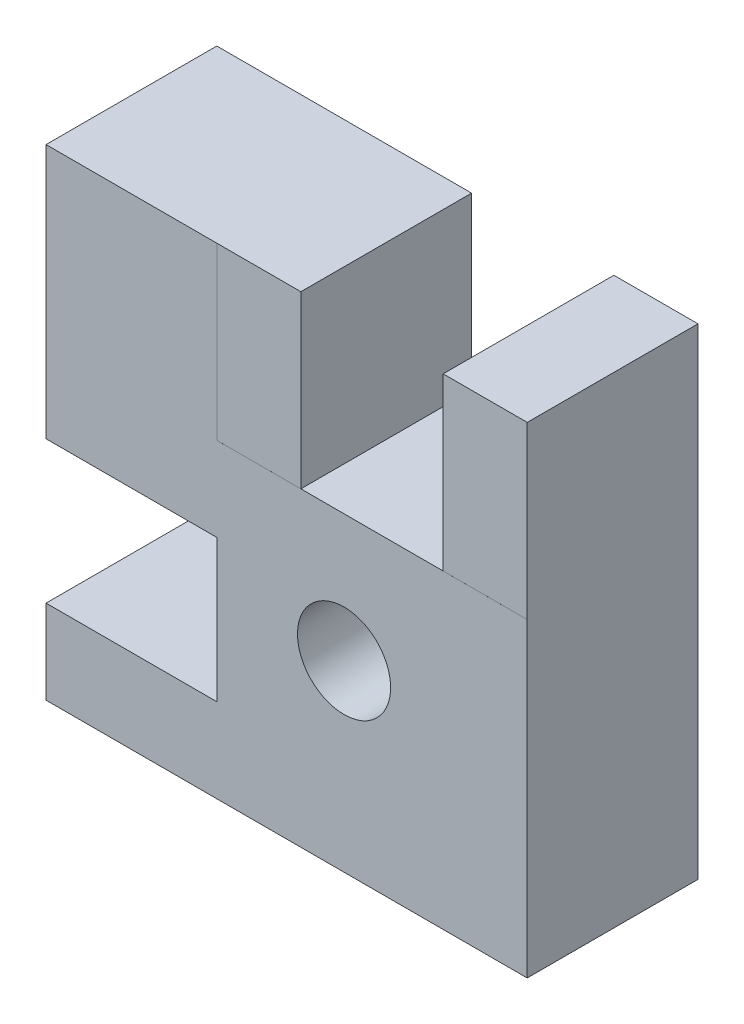
ISO-10303-21;
HEADER;
FILE_DESCRIPTION(('STEP AP214'),'2;1');
FILE_NAME('part.step','',(''),(''),'','','');
FILE_SCHEMA(('AUTOMOTIVE_DESIGN { 1 0 10303 214 1 1 1 1 }'));
ENDSEC;
DATA;
#1=APPLICATION_CONTEXT('core data for automotive mechanical design processes');
#2=APPLICATION_PROTOCOL_DEFINITION('international standard','automotive_design',2000,#1);
#3=PRODUCT_CONTEXT('',#1,'mechanical');
#4=PRODUCT('Part','Part','',(#3));
#5=PRODUCT_RELATED_PRODUCT_CATEGORY('part','',(#4));
#6=PRODUCT_DEFINITION_FORMATION('','',#4);
#7=PRODUCT_DEFINITION_CONTEXT('part definition',#1,'design');
#8=PRODUCT_DEFINITION('design','',#6,#7);
#9=PRODUCT_DEFINITION_SHAPE('','',#8);
#10=(LENGTH_UNIT() NAMED_UNIT(*) SI_UNIT(.MILLI.,.METRE.));
#11=(NAMED_UNIT(*) PLANE_ANGLE_UNIT() SI_UNIT($,.RADIAN.));
#12=(NAMED_UNIT(*) SI_UNIT($,.STERADIAN.) SOLID_ANGLE_UNIT());
#13=UNCERTAINTY_MEASURE_WITH_UNIT(LENGTH_MEASURE(1.E-05),#10,'distance_accuracy_value','');
#14=(GEOMETRIC_REPRESENTATION_CONTEXT(3) GLOBAL_UNCERTAINTY_ASSIGNED_CONTEXT((#13)) GLOBAL_UNIT_ASSIGNED_CONTEXT((#10,
#11,#12)) REPRESENTATION_CONTEXT('',''));
#15=CARTESIAN_POINT('',(0.,0.,0.));
#16=DIRECTION('',(0.,0.,1.));
#17=DIRECTION('',(1.,0.,0.));
#18=AXIS2_PLACEMENT_3D('',#15,#16,#17);
#19=CARTESIAN_POINT('',(7.75,7.75,5.5));
#20=DIRECTION('',(0.,0.,-1.));
#21=DIRECTION('',(-1.,0.,0.));
#22=AXIS2_PLACEMENT_3D('',#19,#20,#21);
#23=PLANE('',#22);
#24=DIRECTION('',(1.,0.,0.));
#25=VECTOR('',#24,1.);
#26=CARTESIAN_POINT('',(-7.75,-7.75,5.5));
#27=LINE('',#26,#25);
#28=CARTESIAN_POINT('',(-7.75,-7.75,5.5));
#29=VERTEX_POINT('',#28);
#30=CARTESIAN_POINT('',(7.75,-7.75,5.5));
#31=VERTEX_POINT('',#30);
#32=EDGE_CURVE('E208',#29,#31,#27,.T.);
#33=ORIENTED_EDGE('',*,*,#32,.T.);
#34=DIRECTION('',(0.,1.,0.));
#35=VECTOR('',#34,1.);
#36=CARTESIAN_POINT('',(7.75,-7.75,5.5));
#37=LINE('',#36,#35);
#38=CARTESIAN_POINT('',(7.74999999999997,2.24999999999998,5.5));
#39=VERTEX_POINT('',#38);
#40=EDGE_CURVE('E169',#31,#39,#37,.T.);
#41=ORIENTED_EDGE('',*,*,#40,.T.);
#42=DIRECTION('',(-1.,0.,0.));
#43=VECTOR('',#42,1.);
#44=CARTESIAN_POINT('',(7.75,2.24999999999998,5.5));
#45=LINE('',#44,#43);
#46=CARTESIAN_POINT('',(-2.25000000000002,2.24999999999998,5.49991686985396));
#47=VERTEX_POINT('',#46);
#48=EDGE_CURVE('E157',#39,#47,#45,.T.);
#49=ORIENTED_EDGE('',*,*,#48,.T.);
#50=CARTESIAN_POINT('',(-2.25000000000004,2.24999999999998,5.5));
#51=DIRECTION('',(0.,1.,0.));
#52=VECTOR('',#51,1.);
#53=LINE('',#50,#52);
#54=CARTESIAN_POINT('',(-2.25000000000004,7.74999999999999,5.49991686985396));
#55=VERTEX_POINT('',#54);
#56=EDGE_CURVE('E182',#47,#55,#53,.T.);
#57=ORIENTED_EDGE('',*,*,#56,.T.);
#58=DIRECTION('',(-1.,0.,0.));
#59=VECTOR('',#58,1.);
#60=CARTESIAN_POINT('',(-7.75,7.75,5.5));
#61=LINE('',#60,#59);
#62=CARTESIAN_POINT('',(-7.75,7.75,5.5));
#63=VERTEX_POINT('',#62);
#64=EDGE_CURVE('E172',#55,#63,#61,.T.);
#65=ORIENTED_EDGE('',*,*,#64,.T.);
#66=DIRECTION('',(0.,-1.,0.));
#67=VECTOR('',#66,1.);
#68=CARTESIAN_POINT('',(-7.75,-7.75,5.5));
#69=LINE('',#68,#67);
#70=CARTESIAN_POINT('',(-7.75,-0.458333333333373,5.49999999999998));
#71=VERTEX_POINT('',#70);
#72=EDGE_CURVE('E176',#63,#71,#69,.T.);
#73=ORIENTED_EDGE('',*,*,#72,.T.);
#74=DIRECTION('',(1.,0.,0.));
#75=VECTOR('',#74,1.);
#76=CARTESIAN_POINT('',(-7.75,-0.458333333333373,5.49999999999998));
#77=LINE('',#76,#75);
#78=CARTESIAN_POINT('',(-2.25,-0.458333333333373,5.49999999999998));
#79=VERTEX_POINT('',#78);
#80=EDGE_CURVE('E146',#71,#79,#77,.T.);
#81=ORIENTED_EDGE('',*,*,#80,.T.);
#82=DIRECTION('',(0.,1.,0.));
#83=VECTOR('',#82,1.);
#84=CARTESIAN_POINT('',(-2.25,7.75,5.5));
#85=LINE('',#84,#83);
#86=CARTESIAN_POINT('',(-2.25,-5.04166666666671,5.49999999999998));
#87=VERTEX_POINT('',#86);
#88=EDGE_CURVE('E149',#87,#79,#85,.T.);
#89=ORIENTED_EDGE('',*,*,#88,.F.);
#90=DIRECTION('',(1.,0.,0.));
#91=VECTOR('',#90,1.);
#92=CARTESIAN_POINT('',(-7.75,-5.04166666666671,5.49999999999998));
#93=LINE('',#92,#91);
#94=CARTESIAN_POINT('',(-7.75,-5.04166666666671,5.49999999999998));
#95=VERTEX_POINT('',#94);
#96=EDGE_CURVE('E136',#95,#87,#93,.T.);
#97=ORIENTED_EDGE('',*,*,#96,.F.);
#98=EDGE_CURVE('E179',#95,#29,#69,.T.);
#99=ORIENTED_EDGE('',*,*,#98,.T.);
#100=EDGE_LOOP('',(#33,#41,#49,#57,#65,#73,#81,#89,#97,#99));
#101=FACE_BOUND('',#100,.T.);
#102=CARTESIAN_POINT('',(1.85000000000004,-1.8500000000001,5.5));
#103=DIRECTION('',(0.,0.,-1.));
#104=DIRECTION('',(-1.,0.,0.));
#105=AXIS2_PLACEMENT_3D('',#102,#103,#104);
#106=CIRCLE('',#105,1.5);
#107=CARTESIAN_POINT('',(0.350000000000037,-1.8500000000001,5.5));
#108=VERTEX_POINT('',#107);
#109=EDGE_CURVE('E440',#108,#108,#106,.F.);
#110=ORIENTED_EDGE('',*,*,#109,.F.);
#111=EDGE_LOOP('',(#110));
#112=FACE_BOUND('',#111,.T.);
#113=ADVANCED_FACE('F31',(#101,#112),#23,.F.);
#114=CARTESIAN_POINT('',(7.75,7.75,0.));
#115=DIRECTION('',(0.,0.,-1.));
#116=DIRECTION('',(-1.,0.,0.));
#117=AXIS2_PLACEMENT_3D('',#114,#115,#116);
#118=PLANE('',#117);
#119=DIRECTION('',(-1.,0.,0.));
#120=VECTOR('',#119,1.);
#121=CARTESIAN_POINT('',(7.75,2.24999999999998,0.));
#122=LINE('',#121,#120);
#123=CARTESIAN_POINT('',(5.04166666666663,2.24999999999998,0.));
#124=VERTEX_POINT('',#123);
#125=CARTESIAN_POINT('',(0.4583333333333,2.24999999999998,0.));
#126=VERTEX_POINT('',#125);
#127=EDGE_CURVE('E42',#124,#126,#122,.T.);
#128=ORIENTED_EDGE('',*,*,#127,.F.);
#129=DIRECTION('',(0.,1.,0.));
#130=VECTOR('',#129,1.);
#131=CARTESIAN_POINT('',(5.04166666666663,7.75,0.));
#132=LINE('',#131,#130);
#133=CARTESIAN_POINT('',(5.04166666666663,7.75,0.));
#134=VERTEX_POINT('',#133);
#135=EDGE_CURVE('E414',#124,#134,#132,.T.);
#136=ORIENTED_EDGE('',*,*,#135,.T.);
#137=DIRECTION('',(-1.,0.,0.));
#138=VECTOR('',#137,1.);
#139=CARTESIAN_POINT('',(-7.75,7.75,0.));
#140=LINE('',#139,#138);
#141=CARTESIAN_POINT('',(7.75,7.75,0.));
#142=VERTEX_POINT('',#141);
#143=EDGE_CURVE('E408',#142,#134,#140,.T.);
#144=ORIENTED_EDGE('',*,*,#143,.F.);
#145=DIRECTION('',(0.,1.,0.));
#146=VECTOR('',#145,1.);
#147=CARTESIAN_POINT('',(7.75,-7.75,0.));
#148=LINE('',#147,#146);
#149=CARTESIAN_POINT('',(7.75,-7.75,0.));
#150=VERTEX_POINT('',#149);
#151=EDGE_CURVE('E161',#150,#142,#148,.T.);
#152=ORIENTED_EDGE('',*,*,#151,.F.);
#153=DIRECTION('',(1.,0.,0.));
#154=VECTOR('',#153,1.);
#155=CARTESIAN_POINT('',(-7.75,-7.75,0.));
#156=LINE('',#155,#154);
#157=CARTESIAN_POINT('',(-7.75,-7.75,0.));
#158=VERTEX_POINT('',#157);
#159=EDGE_CURVE('E173',#158,#150,#156,.T.);
#160=ORIENTED_EDGE('',*,*,#159,.F.);
#161=DIRECTION('',(0.,-1.,0.));
#162=VECTOR('',#161,1.);
#163=CARTESIAN_POINT('',(-7.75,-7.75,0.));
#164=LINE('',#163,#162);
#165=CARTESIAN_POINT('',(-7.75,-5.04166666666671,0.));
#166=VERTEX_POINT('',#165);
#167=EDGE_CURVE('E217',#166,#158,#164,.T.);
#168=ORIENTED_EDGE('',*,*,#167,.F.);
#169=DIRECTION('',(1.,0.,0.));
#170=VECTOR('',#169,1.);
#171=CARTESIAN_POINT('',(-7.75,-5.04166666666671,0.));
#172=LINE('',#171,#170);
#173=CARTESIAN_POINT('',(-2.25,-5.04166666666671,0.));
#174=VERTEX_POINT('',#173);
#175=EDGE_CURVE('E404',#166,#174,#172,.T.);
#176=ORIENTED_EDGE('',*,*,#175,.T.);
#177=DIRECTION('',(0.,1.,0.));
#178=VECTOR('',#177,1.);
#179=CARTESIAN_POINT('',(-2.25,-5.04166666666671,0.));
#180=LINE('',#179,#178);
#181=CARTESIAN_POINT('',(-2.25,-0.458333333333373,0.));
#182=VERTEX_POINT('',#181);
#183=EDGE_CURVE('E50',#174,#182,#180,.T.);
#184=ORIENTED_EDGE('',*,*,#183,.T.);
#185=DIRECTION('',(1.,0.,0.));
#186=VECTOR('',#185,1.);
#187=CARTESIAN_POINT('',(-7.75,-0.458333333333373,0.));
#188=LINE('',#187,#186);
#189=CARTESIAN_POINT('',(-7.75,-0.458333333333373,0.));
#190=VERTEX_POINT('',#189);
#191=EDGE_CURVE('E399',#190,#182,#188,.T.);
#192=ORIENTED_EDGE('',*,*,#191,.F.);
#193=CARTESIAN_POINT('',(-7.75,7.75,0.));
#194=VERTEX_POINT('',#193);
#195=EDGE_CURVE('E403',#194,#190,#164,.T.);
#196=ORIENTED_EDGE('',*,*,#195,.F.);
#197=CARTESIAN_POINT('',(0.4583333333333,7.74999999999998,0.));
#198=VERTEX_POINT('',#197);
#199=EDGE_CURVE('E199',#198,#194,#140,.T.);
#200=ORIENTED_EDGE('',*,*,#199,.F.);
#201=DIRECTION('',(0.,1.,0.));
#202=VECTOR('',#201,1.);
#203=CARTESIAN_POINT('',(0.458333333333301,7.75,0.));
#204=LINE('',#203,#202);
#205=EDGE_CURVE('E11',#126,#198,#204,.T.);
#206=ORIENTED_EDGE('',*,*,#205,.F.);
#207=EDGE_LOOP('',(#128,#136,#144,#152,#160,#168,#176,#184,#192,#196,#200,#206));
#208=FACE_BOUND('',#207,.T.);
#209=CARTESIAN_POINT('',(1.85000000000004,-1.8500000000001,0.));
#210=DIRECTION('',(0.,0.,1.));
#211=DIRECTION('',(0.,-1.,0.));
#212=AXIS2_PLACEMENT_3D('',#209,#210,#211);
#213=CIRCLE('',#212,1.5);
#214=CARTESIAN_POINT('',(1.85000000000004,-3.3500000000001,0.));
#215=VERTEX_POINT('',#214);
#216=EDGE_CURVE('E444',#215,#215,#213,.T.);
#217=ORIENTED_EDGE('',*,*,#216,.T.);
#218=EDGE_LOOP('',(#217));
#219=FACE_BOUND('',#218,.T.);
#220=ADVANCED_FACE('F272',(#208,#219),#118,.T.);
#221=CARTESIAN_POINT('',(-7.75,7.75,5.5));
#222=DIRECTION('',(0.,-1.,0.));
#223=DIRECTION('',(0.,0.,-1.));
#224=AXIS2_PLACEMENT_3D('',#221,#222,#223);
#225=PLANE('',#224);
#226=ORIENTED_EDGE('',*,*,#64,.F.);
#227=DIRECTION('',(-1.,0.,0.));
#228=VECTOR('',#227,1.);
#229=CARTESIAN_POINT('',(7.74999999999997,7.74999999999998,5.49966747941585));
#230=LINE('',#229,#228);
#231=CARTESIAN_POINT('',(0.4583333333333,7.74999999999998,5.49966747941585));
#232=VERTEX_POINT('',#231);
#233=EDGE_CURVE('E194',#232,#55,#230,.T.);
#234=ORIENTED_EDGE('',*,*,#233,.F.);
#235=DIRECTION('',(0.,0.,1.));
#236=VECTOR('',#235,1.);
#237=CARTESIAN_POINT('',(0.4583333333333,7.74999999999998,-0.000332520584143958));
#238=LINE('',#237,#236);
#239=EDGE_CURVE('E145',#198,#232,#238,.T.);
#240=ORIENTED_EDGE('',*,*,#239,.F.);
#241=ORIENTED_EDGE('',*,*,#199,.T.);
#242=DIRECTION('',(0.,0.,-1.));
#243=VECTOR('',#242,1.);
#244=CARTESIAN_POINT('',(-7.75,7.75,5.5));
#245=LINE('',#244,#243);
#246=EDGE_CURVE('E196',#63,#194,#245,.T.);
#247=ORIENTED_EDGE('',*,*,#246,.F.);
#248=EDGE_LOOP('',(#226,#234,#240,#241,#247));
#249=FACE_BOUND('',#248,.T.);
#250=ADVANCED_FACE('F192',(#249),#225,.F.);
#251=CARTESIAN_POINT('',(-7.75,-7.75,5.5));
#252=DIRECTION('',(1.,0.,0.));
#253=DIRECTION('',(0.,0.,-1.));
#254=AXIS2_PLACEMENT_3D('',#251,#252,#253);
#255=PLANE('',#254);
#256=DIRECTION('',(0.,0.,1.));
#257=VECTOR('',#256,1.);
#258=CARTESIAN_POINT('',(-7.75,-5.04166666666671,0.));
#259=LINE('',#258,#257);
#260=EDGE_CURVE('E141',#166,#95,#259,.T.);
#261=ORIENTED_EDGE('',*,*,#260,.F.);
#262=ORIENTED_EDGE('',*,*,#167,.T.);
#263=DIRECTION('',(0.,0.,-1.));
#264=VECTOR('',#263,1.);
#265=CARTESIAN_POINT('',(-7.75,-7.75,5.5));
#266=LINE('',#265,#264);
#267=EDGE_CURVE('E204',#29,#158,#266,.T.);
#268=ORIENTED_EDGE('',*,*,#267,.F.);
#269=ORIENTED_EDGE('',*,*,#98,.F.);
#270=EDGE_LOOP('',(#261,#262,#268,#269));
#271=FACE_BOUND('',#270,.T.);
#272=ADVANCED_FACE('F215',(#271),#255,.F.);
#273=CARTESIAN_POINT('',(7.75,-7.75,5.5));
#274=DIRECTION('',(-1.,0.,0.));
#275=DIRECTION('',(0.,0.,1.));
#276=AXIS2_PLACEMENT_3D('',#273,#274,#275);
#277=PLANE('',#276);
#278=DIRECTION('',(0.,1.,0.));
#279=VECTOR('',#278,1.);
#280=CARTESIAN_POINT('',(7.74999999999997,2.24999999999998,5.49966747941585));
#281=LINE('',#280,#279);
#282=CARTESIAN_POINT('',(7.74999999999997,2.24999999999998,5.49966747941585));
#283=VERTEX_POINT('',#282);
#284=CARTESIAN_POINT('',(7.74999999999997,7.74999999999998,5.49966747941585));
#285=VERTEX_POINT('',#284);
#286=EDGE_CURVE('E189',#283,#285,#281,.T.);
#287=ORIENTED_EDGE('',*,*,#286,.F.);
#288=DIRECTION('',(0.,0.,1.));
#289=VECTOR('',#288,1.);
#290=CARTESIAN_POINT('',(7.74999999999997,2.24999999999998,5.49966747941585));
#291=LINE('',#290,#289);
#292=EDGE_CURVE('E229',#283,#39,#291,.T.);
#293=ORIENTED_EDGE('',*,*,#292,.T.);
#294=ORIENTED_EDGE('',*,*,#40,.F.);
#295=DIRECTION('',(0.,0.,-1.));
#296=VECTOR('',#295,1.);
#297=CARTESIAN_POINT('',(7.75,-7.75,5.5));
#298=LINE('',#297,#296);
#299=EDGE_CURVE('E209',#31,#150,#298,.T.);
#300=ORIENTED_EDGE('',*,*,#299,.T.);
#301=ORIENTED_EDGE('',*,*,#151,.T.);
#302=DIRECTION('',(0.,0.,-1.));
#303=VECTOR('',#302,1.);
#304=CARTESIAN_POINT('',(7.75,7.75,5.5));
#305=LINE('',#304,#303);
#306=EDGE_CURVE('E203',#285,#142,#305,.T.);
#307=ORIENTED_EDGE('',*,*,#306,.F.);
#308=EDGE_LOOP('',(#287,#293,#294,#300,#301,#307));
#309=FACE_BOUND('',#308,.T.);
#310=ADVANCED_FACE('F33',(#309),#277,.F.);
#311=DIRECTION('',(0.,0.,1.));
#312=VECTOR('',#311,1.);
#313=CARTESIAN_POINT('',(5.04166666666663,7.74999999999998,-0.000332520584143958));
#314=LINE('',#313,#312);
#315=CARTESIAN_POINT('',(5.04166666666663,7.74999999999998,5.49966747941585));
#316=VERTEX_POINT('',#315);
#317=EDGE_CURVE('E58',#134,#316,#314,.T.);
#318=ORIENTED_EDGE('',*,*,#317,.T.);
#319=EDGE_CURVE('E235',#285,#316,#230,.T.);
#320=ORIENTED_EDGE('',*,*,#319,.F.);
#321=ORIENTED_EDGE('',*,*,#306,.T.);
#322=ORIENTED_EDGE('',*,*,#143,.T.);
#323=EDGE_LOOP('',(#318,#320,#321,#322));
#324=FACE_BOUND('',#323,.T.);
#325=ADVANCED_FACE('F280',(#324),#225,.F.);
#326=ORIENTED_EDGE('',*,*,#195,.T.);
#327=DIRECTION('',(0.,0.,1.));
#328=VECTOR('',#327,1.);
#329=CARTESIAN_POINT('',(-7.75,-0.458333333333373,0.));
#330=LINE('',#329,#328);
#331=EDGE_CURVE('E151',#190,#71,#330,.T.);
#332=ORIENTED_EDGE('',*,*,#331,.T.);
#333=ORIENTED_EDGE('',*,*,#72,.F.);
#334=ORIENTED_EDGE('',*,*,#246,.T.);
#335=EDGE_LOOP('',(#326,#332,#333,#334));
#336=FACE_BOUND('',#335,.T.);
#337=ADVANCED_FACE('F207',(#336),#255,.F.);
#338=CARTESIAN_POINT('',(-7.75,-7.75,5.5));
#339=DIRECTION('',(0.,1.,0.));
#340=DIRECTION('',(0.,0.,1.));
#341=AXIS2_PLACEMENT_3D('',#338,#339,#340);
#342=PLANE('',#341);
#343=ORIENTED_EDGE('',*,*,#159,.T.);
#344=ORIENTED_EDGE('',*,*,#299,.F.);
#345=ORIENTED_EDGE('',*,*,#32,.F.);
#346=ORIENTED_EDGE('',*,*,#267,.T.);
#347=EDGE_LOOP('',(#343,#344,#345,#346));
#348=FACE_BOUND('',#347,.T.);
#349=ADVANCED_FACE('F221',(#348),#342,.F.);
#350=CARTESIAN_POINT('',(-7.75,-0.458333333333373,0.));
#351=DIRECTION('',(0.,1.,0.));
#352=DIRECTION('',(1.,0.,0.));
#353=AXIS2_PLACEMENT_3D('',#350,#351,#352);
#354=PLANE('',#353);
#355=ORIENTED_EDGE('',*,*,#331,.F.);
#356=ORIENTED_EDGE('',*,*,#191,.T.);
#357=DIRECTION('',(0.,0.,1.));
#358=VECTOR('',#357,1.);
#359=CARTESIAN_POINT('',(-2.25,-0.458333333333373,0.));
#360=LINE('',#359,#358);
#361=EDGE_CURVE('E152',#182,#79,#360,.T.);
#362=ORIENTED_EDGE('',*,*,#361,.T.);
#363=ORIENTED_EDGE('',*,*,#80,.F.);
#364=EDGE_LOOP('',(#355,#356,#362,#363));
#365=FACE_BOUND('',#364,.T.);
#366=ADVANCED_FACE('F278',(#365),#354,.F.);
#367=CARTESIAN_POINT('',(-7.75,-5.04166666666671,0.));
#368=DIRECTION('',(0.,1.,0.));
#369=DIRECTION('',(0.,0.,-1.));
#370=AXIS2_PLACEMENT_3D('',#367,#368,#369);
#371=PLANE('',#370);
#372=ORIENTED_EDGE('',*,*,#96,.T.);
#373=DIRECTION('',(0.,0.,1.));
#374=VECTOR('',#373,1.);
#375=CARTESIAN_POINT('',(-2.25,-5.04166666666671,0.));
#376=LINE('',#375,#374);
#377=EDGE_CURVE('E138',#174,#87,#376,.T.);
#378=ORIENTED_EDGE('',*,*,#377,.F.);
#379=ORIENTED_EDGE('',*,*,#175,.F.);
#380=ORIENTED_EDGE('',*,*,#260,.T.);
#381=EDGE_LOOP('',(#372,#378,#379,#380));
#382=FACE_BOUND('',#381,.T.);
#383=ADVANCED_FACE('F137',(#382),#371,.T.);
#384=CARTESIAN_POINT('',(-2.25,-7.75000000000003,55.5));
#385=DIRECTION('',(-1.,0.,0.));
#386=DIRECTION('',(0.,1.,0.));
#387=AXIS2_PLACEMENT_3D('',#384,#385,#386);
#388=PLANE('',#387);
#389=ORIENTED_EDGE('',*,*,#88,.T.);
#390=ORIENTED_EDGE('',*,*,#361,.F.);
#391=ORIENTED_EDGE('',*,*,#183,.F.);
#392=ORIENTED_EDGE('',*,*,#377,.T.);
#393=EDGE_LOOP('',(#389,#390,#391,#392));
#394=FACE_BOUND('',#393,.T.);
#395=ADVANCED_FACE('F148',(#394),#388,.T.);
#396=CARTESIAN_POINT('',(7.74999999999994,2.24999999999998,55.4996674794159));
#397=DIRECTION('',(0.,-1.,0.));
#398=DIRECTION('',(-1.,0.,0.));
#399=AXIS2_PLACEMENT_3D('',#396,#397,#398);
#400=PLANE('',#399);
#401=ORIENTED_EDGE('',*,*,#292,.F.);
#402=DIRECTION('',(-1.,0.,0.));
#403=VECTOR('',#402,1.);
#404=CARTESIAN_POINT('',(7.74999999999997,2.24999999999998,5.49966747941585));
#405=LINE('',#404,#403);
#406=CARTESIAN_POINT('',(5.04166666666663,2.24999999999998,5.49966747941585));
#407=VERTEX_POINT('',#406);
#408=EDGE_CURVE('E237',#283,#407,#405,.T.);
#409=ORIENTED_EDGE('',*,*,#408,.T.);
#410=DIRECTION('',(0.,0.,1.));
#411=VECTOR('',#410,1.);
#412=CARTESIAN_POINT('',(5.04166666666663,2.24999999999998,-0.000332520584143958));
#413=LINE('',#412,#411);
#414=EDGE_CURVE('E419',#124,#407,#413,.T.);
#415=ORIENTED_EDGE('',*,*,#414,.F.);
#416=ORIENTED_EDGE('',*,*,#127,.T.);
#417=DIRECTION('',(0.,0.,1.));
#418=VECTOR('',#417,1.);
#419=CARTESIAN_POINT('',(0.4583333333333,2.24999999999998,-0.000332520584143958));
#420=LINE('',#419,#418);
#421=CARTESIAN_POINT('',(0.4583333333333,2.24999999999998,5.49966747941585));
#422=VERTEX_POINT('',#421);
#423=EDGE_CURVE('E417',#126,#422,#420,.T.);
#424=ORIENTED_EDGE('',*,*,#423,.T.);
#425=EDGE_CURVE('E234',#422,#47,#405,.T.);
#426=ORIENTED_EDGE('',*,*,#425,.T.);
#427=ORIENTED_EDGE('',*,*,#48,.F.);
#428=EDGE_LOOP('',(#401,#409,#415,#416,#424,#426,#427));
#429=FACE_BOUND('',#428,.T.);
#430=ADVANCED_FACE('F262',(#429),#400,.F.);
#431=CARTESIAN_POINT('',(7.74999999999997,2.24999999999998,5.49966747941585));
#432=DIRECTION('',(0.,0.,-1.));
#433=DIRECTION('',(0.,-1.,0.));
#434=AXIS2_PLACEMENT_3D('',#431,#432,#433);
#435=PLANE('',#434);
#436=ORIENTED_EDGE('',*,*,#408,.F.);
#437=ORIENTED_EDGE('',*,*,#286,.T.);
#438=ORIENTED_EDGE('',*,*,#319,.T.);
#439=DIRECTION('',(0.,1.,0.));
#440=VECTOR('',#439,1.);
#441=CARTESIAN_POINT('',(5.04166666666663,2.24999999999998,5.49966747941585));
#442=LINE('',#441,#440);
#443=EDGE_CURVE('E158',#407,#316,#442,.T.);
#444=ORIENTED_EDGE('',*,*,#443,.F.);
#445=EDGE_LOOP('',(#436,#437,#438,#444));
#446=FACE_BOUND('',#445,.T.);
#447=ADVANCED_FACE('F260',(#446),#435,.F.);
#448=DIRECTION('',(0.,1.,0.));
#449=VECTOR('',#448,1.);
#450=CARTESIAN_POINT('',(0.4583333333333,2.24999999999998,5.49966747941585));
#451=LINE('',#450,#449);
#452=EDGE_CURVE('E163',#422,#232,#451,.T.);
#453=ORIENTED_EDGE('',*,*,#452,.T.);
#454=ORIENTED_EDGE('',*,*,#233,.T.);
#455=ORIENTED_EDGE('',*,*,#56,.F.);
#456=ORIENTED_EDGE('',*,*,#425,.F.);
#457=EDGE_LOOP('',(#453,#454,#455,#456));
#458=FACE_BOUND('',#457,.T.);
#459=ADVANCED_FACE('F249',(#458),#435,.F.);
#460=CARTESIAN_POINT('',(0.4583333333333,2.24999999999998,-0.000332520584143958));
#461=DIRECTION('',(-1.,0.,0.));
#462=DIRECTION('',(0.,1.,0.));
#463=AXIS2_PLACEMENT_3D('',#460,#461,#462);
#464=PLANE('',#463);
#465=ORIENTED_EDGE('',*,*,#205,.T.);
#466=ORIENTED_EDGE('',*,*,#239,.T.);
#467=ORIENTED_EDGE('',*,*,#452,.F.);
#468=ORIENTED_EDGE('',*,*,#423,.F.);
#469=EDGE_LOOP('',(#465,#466,#467,#468));
#470=FACE_BOUND('',#469,.T.);
#471=ADVANCED_FACE('F259',(#470),#464,.F.);
#472=CARTESIAN_POINT('',(5.04166666666663,2.24999999999998,-0.000332520584143958));
#473=DIRECTION('',(-1.,0.,0.));
#474=DIRECTION('',(0.,0.,-1.));
#475=AXIS2_PLACEMENT_3D('',#472,#473,#474);
#476=PLANE('',#475);
#477=ORIENTED_EDGE('',*,*,#414,.T.);
#478=ORIENTED_EDGE('',*,*,#443,.T.);
#479=ORIENTED_EDGE('',*,*,#317,.F.);
#480=ORIENTED_EDGE('',*,*,#135,.F.);
#481=EDGE_LOOP('',(#477,#478,#479,#480));
#482=FACE_BOUND('',#481,.T.);
#483=ADVANCED_FACE('F261',(#482),#476,.T.);
#484=CARTESIAN_POINT('',(1.85000000000004,-1.8500000000001,9.99999999999996));
#485=DIRECTION('',(0.,0.,-1.));
#486=DIRECTION('',(0.,1.,0.));
#487=AXIS2_PLACEMENT_3D('',#484,#485,#486);
#488=CYLINDRICAL_SURFACE('',#487,1.5);
#489=ORIENTED_EDGE('',*,*,#216,.F.);
#490=EDGE_LOOP('',(#489));
#491=FACE_BOUND('',#490,.T.);
#492=ORIENTED_EDGE('',*,*,#109,.T.);
#493=EDGE_LOOP('',(#492));
#494=FACE_BOUND('',#493,.T.);
#495=ADVANCED_FACE('F266',(#491,#494),#488,.F.);
#496=CLOSED_SHELL('',(#113,#220,#250,#272,#310,#325,#337,#349,#366,#383,#395,#430,#447,#459,
#471,#483,#495));
#497=MANIFOLD_SOLID_BREP('B2',#496);
#498=ADVANCED_BREP_SHAPE_REPRESENTATION('',(#18,#497),#14);
#499=SHAPE_DEFINITION_REPRESENTATION(#9,#498);
ENDSEC;
END-ISO-10303-21;
